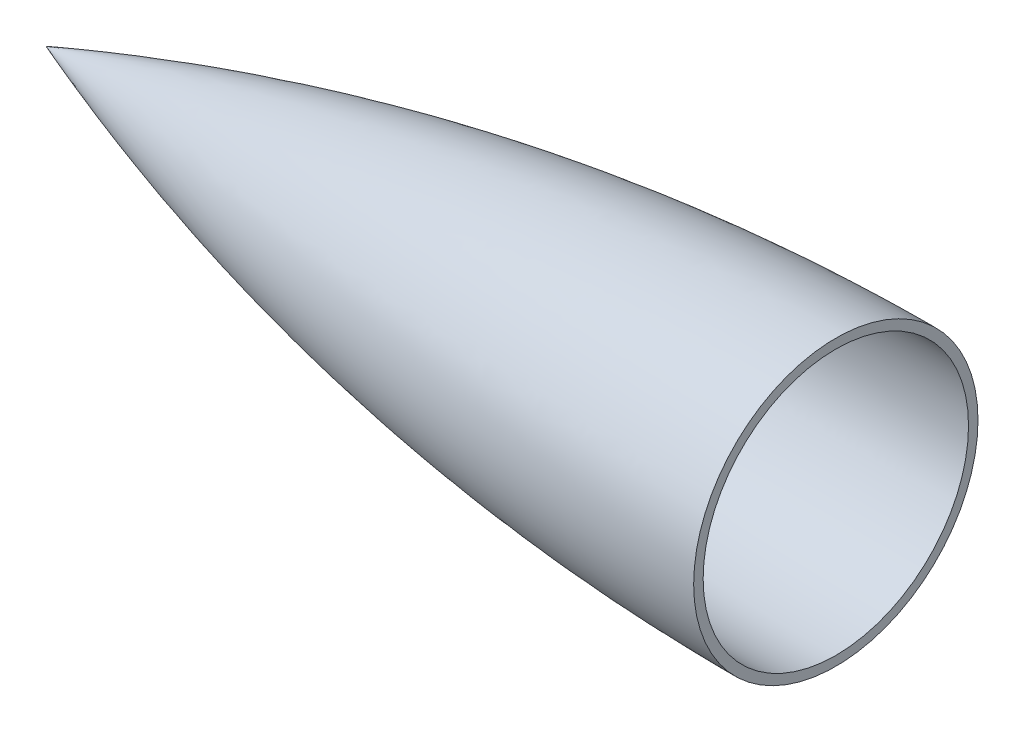
ISO-10303-21;
HEADER;
FILE_DESCRIPTION(('STEP AP214'),'2;1');
FILE_NAME('part.step','',(''),(''),'','','');
FILE_SCHEMA(('AUTOMOTIVE_DESIGN { 1 0 10303 214 1 1 1 1 }'));
ENDSEC;
DATA;
#1=APPLICATION_CONTEXT('core data for automotive mechanical design processes');
#2=APPLICATION_PROTOCOL_DEFINITION('international standard','automotive_design',2000,#1);
#3=PRODUCT_CONTEXT('',#1,'mechanical');
#4=PRODUCT('Part','Part','',(#3));
#5=PRODUCT_RELATED_PRODUCT_CATEGORY('part','',(#4));
#6=PRODUCT_DEFINITION_FORMATION('','',#4);
#7=PRODUCT_DEFINITION_CONTEXT('part definition',#1,'design');
#8=PRODUCT_DEFINITION('design','',#6,#7);
#9=PRODUCT_DEFINITION_SHAPE('','',#8);
#10=(LENGTH_UNIT() NAMED_UNIT(*) SI_UNIT(.MILLI.,.METRE.));
#11=(NAMED_UNIT(*) PLANE_ANGLE_UNIT() SI_UNIT($,.RADIAN.));
#12=(NAMED_UNIT(*) SI_UNIT($,.STERADIAN.) SOLID_ANGLE_UNIT());
#13=UNCERTAINTY_MEASURE_WITH_UNIT(LENGTH_MEASURE(1.E-05),#10,'distance_accuracy_value','');
#14=(GEOMETRIC_REPRESENTATION_CONTEXT(3) GLOBAL_UNCERTAINTY_ASSIGNED_CONTEXT((#13)) GLOBAL_UNIT_ASSIGNED_CONTEXT((#10,
#11,#12)) REPRESENTATION_CONTEXT('',''));
#15=CARTESIAN_POINT('',(0.,0.,0.));
#16=DIRECTION('',(0.,0.,1.));
#17=DIRECTION('',(1.,0.,0.));
#18=AXIS2_PLACEMENT_3D('',#15,#16,#17);
#19=CARTESIAN_POINT('',(250.000000001601,0.,-45.));
#20=CARTESIAN_POINT('',(249.682753819303,0.,-45.000000000001));
#21=CARTESIAN_POINT('',(249.047165821142,0.,-44.9994628827992));
#22=CARTESIAN_POINT('',(247.617281122081,0.,-44.9970458553814));
#23=CARTESIAN_POINT('',(246.231731715728,0.,-44.9906004634236));
#24=CARTESIAN_POINT('',(244.670319451456,0.,-44.9809324117025));
#25=CARTESIAN_POINT('',(243.163095115999,0.,-44.9680417436784));
#26=CARTESIAN_POINT('',(241.638882415672,0.,-44.9519285172921));
#27=CARTESIAN_POINT('',(240.120479762347,0.,-44.932592804978));
#28=CARTESIAN_POINT('',(238.220058241684,0.,-44.9043951660734));
#29=CARTESIAN_POINT('',(235.940682167867,0.,-44.864113404556));
#30=CARTESIAN_POINT('',(233.281021873147,0.,-44.807720155617));
#31=CARTESIAN_POINT('',(230.242044265543,0.,-44.7303833927708));
#32=CARTESIAN_POINT('',(227.20324496479,0.,-44.6401606837516));
#33=CARTESIAN_POINT('',(224.164957447808,0.,-44.5370536504946));
#34=CARTESIAN_POINT('',(221.127073954689,0.,-44.4210641462195));
#35=CARTESIAN_POINT('',(218.089745776704,0.,-44.2921942563917));
#36=CARTESIAN_POINT('',(215.052969657774,0.,-44.1504462992027));
#37=CARTESIAN_POINT('',(212.016834853689,0.,-43.9958228245218));
#38=CARTESIAN_POINT('',(208.981375405902,0.,-43.8283266109628));
#39=CARTESIAN_POINT('',(205.946657751534,0.,-43.6479606730414));
#40=CARTESIAN_POINT('',(202.154248213683,0.,-43.4064201459423));
#41=CARTESIAN_POINT('',(197.605051490867,0.,-43.0908455028409));
#42=CARTESIAN_POINT('',(192.300362370409,0.,-42.6851741792301));
#43=CARTESIAN_POINT('',(186.24201083089,0.,-42.1701533625944));
#44=CARTESIAN_POINT('',(180.188244336868,0.,-41.6037730978271));
#45=CARTESIAN_POINT('',(174.139498814474,0.,-40.9860741586634));
#46=CARTESIAN_POINT('',(166.585386817079,0.,-40.1498576349434));
#47=CARTESIAN_POINT('',(157.532234031388,0.,-39.0439456198505));
#48=CARTESIAN_POINT('',(148.495435574017,0.,-37.810162361996));
#49=CARTESIAN_POINT('',(139.477158719865,0.,-36.4488039435302));
#50=CARTESIAN_POINT('',(130.474994537663,0.,-34.985584453941));
#51=CARTESIAN_POINT('',(121.489808607384,0.,-33.4206449815079));
#52=CARTESIAN_POINT('',(112.527457587515,0.,-31.7288308559079));
#53=CARTESIAN_POINT('',(103.590096004027,0.,-29.9105498752083));
#54=CARTESIAN_POINT('',(96.1600172806627,0.,-28.3112226601881));
#55=CARTESIAN_POINT('',(90.2270253225319,0.,-26.9814008669732));
#56=CARTESIAN_POINT('',(82.8251339202143,0.,-25.2562839764021));
#57=CARTESIAN_POINT('',(73.9667295019805,0.,-23.085819843032));
#58=CARTESIAN_POINT('',(65.1396594601575,0.,-20.7903028519481));
#59=CARTESIAN_POINT('',(56.3461697320049,0.,-18.3703316152346));
#60=CARTESIAN_POINT('',(49.0415449608774,0.,-16.2709542187977));
#61=CARTESIAN_POINT('',(43.2124702427797,0.,-14.5420196195187));
#62=CARTESIAN_POINT('',(37.3979229210091,0.,-12.7635842736563));
#63=CARTESIAN_POINT('',(31.5992982435684,0.,-10.9361396269452));
#64=CARTESIAN_POINT('',(26.5382058407579,0.,-9.29376477167991));
#65=CARTESIAN_POINT('',(22.2118518676868,0.,-7.85601678704013));
#66=CARTESIAN_POINT('',(17.8907418367704,0.,-6.39272549032875));
#67=CARTESIAN_POINT('',(14.6616072499024,0.,-5.27898592233498));
#68=CARTESIAN_POINT('',(11.7854619936391,0.,-4.27079300681318));
#69=CARTESIAN_POINT('',(9.28953226291448,0.,-3.38429141929322));
#70=CARTESIAN_POINT('',(7.82992524395084,0.,-2.86186859651477));
#71=CARTESIAN_POINT('',(6.48097071990856,0.,-2.37717624226541));
#72=CARTESIAN_POINT('',(4.85947572254319,0.,-1.78764558499007));
#73=CARTESIAN_POINT('',(3.51779218985783,0.,-1.30136050625101));
#74=CARTESIAN_POINT('',(1.43519159810059,0.,-0.5322503252652));
#75=CARTESIAN_POINT('',(0.594667791723522,0.,-0.221248868355296));
#76=CARTESIAN_POINT('',(-8.35911975393574E-11,0.,3.11004655717512E-11));
#77=B_SPLINE_CURVE_WITH_KNOTS('',4,(#19,#20,#21,#22,#23,#24,#25,#26,#27,#28,#29,#30,#31,#32,#33,
#34,#35,#36,#37,#38,#39,#40,#41,#42,#43,#44,#45,#46,#47,#48,#49,#50,#51,#52,#53,#54,#55,#56,#57,
#58,#59,#60,#61,#62,#63,#64,#65,#66,#67,#68,#69,#70,#71,#72,#73,#74,#75,#76),.UNSPECIFIED.,.F.,
.F.,(5,1,1,1,1,1,1,1,1,1,1,1,1,1,1,1,1,1,1,1,1,1,1,1,1,1,1,1,1,1,1,1,1,1,1,1,1,1,1,1,1,1,1,1,1,
1,1,1,1,1,1,1,1,1,5),(0.0834130077958932,0.0883822961412844,0.0933515844866757,
0.0983208728320669,0.103290161177458,0.108259449522849,0.113228737868241,0.118198026213632,
0.123167314559023,0.13310589101726,0.143044467475496,0.152983043933732,0.162921620391969,
0.17286019724877,0.182798774105571,0.192737350962373,0.202675927819174,0.212614504519659,
0.222553081220144,0.23249165792063,0.242430234621115,0.262307387437352,0.282184540253589,
0.302061693760234,0.32193884726688,0.341816001873939,0.361693156480999,0.401447461179583,
0.44120176494361,0.461078919587591,0.480956074231572,0.520710380875337,0.560464681176746,
0.580341836465686,0.600218991754625,0.620096151034144,0.639973310313663,0.679727604095889,
0.719481905070318,0.739359062433057,0.759236219795796,0.779113374159564,0.798990528523332,
0.818867677687638,0.838744826851944,0.848683406381489,0.858621985911034,0.878499144970123,
0.883468435072133,0.888437725174143,0.893407015276152,0.898376305378162,0.903345595480171,
0.908314885582181,0.9182534657862),.UNSPECIFIED.);
#78=CARTESIAN_POINT('',(250.000000001601,0.,0.));
#79=DIRECTION('',(1.,0.,0.));
#80=AXIS1_PLACEMENT('',#78,#79);
#81=SURFACE_OF_REVOLUTION('',#77,#80);
#82=CARTESIAN_POINT('',(0.,0.,0.));
#83=VERTEX_POINT('',#82);
#84=VERTEX_LOOP('',#83);
#85=FACE_BOUND('',#84,.T.);
#86=CARTESIAN_POINT('',(250.000000001601,0.,0.));
#87=DIRECTION('',(1.,0.,0.));
#88=DIRECTION('',(0.,0.,-1.));
#89=AXIS2_PLACEMENT_3D('',#86,#87,#88);
#90=CIRCLE('',#89,44.9999999862204);
#91=CARTESIAN_POINT('',(250.000000001601,0.,-44.9999999862204));
#92=VERTEX_POINT('',#91);
#93=EDGE_CURVE('E11',#92,#92,#90,.T.);
#94=ORIENTED_EDGE('',*,*,#93,.F.);
#95=EDGE_LOOP('',(#94));
#96=FACE_BOUND('',#95,.T.);
#97=ADVANCED_FACE('F36',(#85,#96),#81,.F.);
#98=CARTESIAN_POINT('',(250.000000001601,0.,-44.9999999862204));
#99=DIRECTION('',(1.,0.,0.));
#100=DIRECTION('',(0.,0.,-1.));
#101=AXIS2_PLACEMENT_3D('',#98,#99,#100);
#102=PLANE('',#101);
#103=CARTESIAN_POINT('',(250.000000001601,0.,0.));
#104=DIRECTION('',(1.,0.,0.));
#105=DIRECTION('',(0.,0.,-1.));
#106=AXIS2_PLACEMENT_3D('',#103,#104,#105);
#107=CIRCLE('',#106,42.);
#108=CARTESIAN_POINT('',(250.000000001601,0.,-42.));
#109=VERTEX_POINT('',#108);
#110=EDGE_CURVE('E43',#109,#109,#107,.T.);
#111=ORIENTED_EDGE('',*,*,#110,.F.);
#112=EDGE_LOOP('',(#111));
#113=FACE_BOUND('',#112,.T.);
#114=ORIENTED_EDGE('',*,*,#93,.T.);
#115=EDGE_LOOP('',(#114));
#116=FACE_BOUND('',#115,.T.);
#117=ADVANCED_FACE('F52',(#113,#116),#102,.T.);
#118=CARTESIAN_POINT('',(250.000000001601,0.,-45.));
#119=CARTESIAN_POINT('',(249.682753819303,0.,-45.000000000001));
#120=CARTESIAN_POINT('',(249.047165821142,0.,-44.9994628827992));
#121=CARTESIAN_POINT('',(247.617281122081,0.,-44.9970458553814));
#122=CARTESIAN_POINT('',(246.231731715728,0.,-44.9906004634236));
#123=CARTESIAN_POINT('',(244.670319451456,0.,-44.9809324117025));
#124=CARTESIAN_POINT('',(243.163095115999,0.,-44.9680417436784));
#125=CARTESIAN_POINT('',(241.638882415672,0.,-44.9519285172921));
#126=CARTESIAN_POINT('',(240.120479762347,0.,-44.932592804978));
#127=CARTESIAN_POINT('',(238.220058241684,0.,-44.9043951660734));
#128=CARTESIAN_POINT('',(235.940682167867,0.,-44.864113404556));
#129=CARTESIAN_POINT('',(233.281021873147,0.,-44.807720155617));
#130=CARTESIAN_POINT('',(230.242044265543,0.,-44.7303833927708));
#131=CARTESIAN_POINT('',(227.20324496479,0.,-44.6401606837516));
#132=CARTESIAN_POINT('',(224.164957447808,0.,-44.5370536504946));
#133=CARTESIAN_POINT('',(221.127073954689,0.,-44.4210641462195));
#134=CARTESIAN_POINT('',(218.089745776704,0.,-44.2921942563917));
#135=CARTESIAN_POINT('',(215.052969657774,0.,-44.1504462992027));
#136=CARTESIAN_POINT('',(212.016834853689,0.,-43.9958228245218));
#137=CARTESIAN_POINT('',(208.981375405902,0.,-43.8283266109628));
#138=CARTESIAN_POINT('',(205.946657751534,0.,-43.6479606730414));
#139=CARTESIAN_POINT('',(202.154248213683,0.,-43.4064201459423));
#140=CARTESIAN_POINT('',(197.605051490867,0.,-43.0908455028409));
#141=CARTESIAN_POINT('',(192.300362370409,0.,-42.6851741792301));
#142=CARTESIAN_POINT('',(186.24201083089,0.,-42.1701533625944));
#143=CARTESIAN_POINT('',(180.188244336868,0.,-41.6037730978271));
#144=CARTESIAN_POINT('',(174.139498814474,0.,-40.9860741586634));
#145=CARTESIAN_POINT('',(166.585386817079,0.,-40.1498576349434));
#146=CARTESIAN_POINT('',(157.532234031388,0.,-39.0439456198505));
#147=CARTESIAN_POINT('',(148.495435574017,0.,-37.810162361996));
#148=CARTESIAN_POINT('',(139.477158719865,0.,-36.4488039435302));
#149=CARTESIAN_POINT('',(130.474994537663,0.,-34.985584453941));
#150=CARTESIAN_POINT('',(121.489808607384,0.,-33.4206449815079));
#151=CARTESIAN_POINT('',(112.527457587515,0.,-31.7288308559079));
#152=CARTESIAN_POINT('',(103.590096004027,0.,-29.9105498752083));
#153=CARTESIAN_POINT('',(96.1600172806627,0.,-28.3112226601881));
#154=CARTESIAN_POINT('',(90.2270253225319,0.,-26.9814008669732));
#155=CARTESIAN_POINT('',(82.8251339202143,0.,-25.2562839764021));
#156=CARTESIAN_POINT('',(73.9667295019805,0.,-23.085819843032));
#157=CARTESIAN_POINT('',(65.1396594601575,0.,-20.7903028519481));
#158=CARTESIAN_POINT('',(56.3461697320049,0.,-18.3703316152346));
#159=CARTESIAN_POINT('',(49.0415449608774,0.,-16.2709542187977));
#160=CARTESIAN_POINT('',(43.2124702427797,0.,-14.5420196195187));
#161=CARTESIAN_POINT('',(37.3979229210091,0.,-12.7635842736563));
#162=CARTESIAN_POINT('',(31.5992982435684,0.,-10.9361396269452));
#163=CARTESIAN_POINT('',(26.5382058407579,0.,-9.29376477167991));
#164=CARTESIAN_POINT('',(22.2118518676868,0.,-7.85601678704013));
#165=CARTESIAN_POINT('',(17.8907418367704,0.,-6.39272549032875));
#166=CARTESIAN_POINT('',(14.6616072499024,0.,-5.27898592233498));
#167=CARTESIAN_POINT('',(11.7854619936391,0.,-4.27079300681318));
#168=CARTESIAN_POINT('',(9.43568120916972,0.,-3.43620044192104));
#169=CARTESIAN_POINT('',(8.49349497597747,0.,-3.09931886347783));
#170=CARTESIAN_POINT('',(7.93216719962397,0.,-2.89813785104592));
#171=CARTESIAN_POINT('',(7.72477390379313,0.,-2.82372050747118));
#172=B_SPLINE_CURVE_WITH_KNOTS('',4,(#118,#119,#120,#121,#122,#123,#124,#125,#126,#127,#128,
#129,#130,#131,#132,#133,#134,#135,#136,#137,#138,#139,#140,#141,#142,#143,#144,#145,#146,#147,
#148,#149,#150,#151,#152,#153,#154,#155,#156,#157,#158,#159,#160,#161,#162,#163,#164,#165,#166,
#167,#168,#169,#170,#171),.UNSPECIFIED.,.F.,.F.,(5,1,1,1,1,1,1,1,1,1,1,1,1,1,1,1,1,1,1,1,1,1,1,
1,1,1,1,1,1,1,1,1,1,1,1,1,1,1,1,1,1,1,1,1,1,1,1,1,1,1,5),(0.0834130077958932,0.0883822961412844,
0.0933515844866757,0.0983208728320669,0.103290161177458,0.108259449522849,0.113228737868241,
0.118198026213632,0.123167314559023,0.13310589101726,0.143044467475496,0.152983043933732,
0.162921620391969,0.17286019724877,0.182798774105571,0.192737350962373,0.202675927819174,
0.212614504519659,0.222553081220144,0.23249165792063,0.242430234621115,0.262307387437352,
0.282184540253589,0.302061693760234,0.32193884726688,0.341816001873939,0.361693156480999,
0.401447461179583,0.44120176494361,0.461078919587591,0.480956074231572,0.520710380875337,
0.560464681176746,0.580341836465686,0.600218991754625,0.620096151034144,0.639973310313663,
0.679727604095889,0.719481905070318,0.739359062433057,0.759236219795796,0.779113374159564,
0.798990528523332,0.818867677687638,0.838744826851944,0.848683406381489,0.858621985911034,
0.878499144970123,0.883468435072133,0.888437725174143,0.89137018093559),.UNSPECIFIED.);
#173=CARTESIAN_POINT('',(250.000000001601,0.,0.));
#174=DIRECTION('',(1.,0.,0.));
#175=AXIS1_PLACEMENT('',#173,#174);
#176=SURFACE_OF_REVOLUTION('',#172,#175);
#177=OFFSET_SURFACE('',#176,3.,.F.);
#178=CARTESIAN_POINT('',(8.73798784748263,0.,0.));
#179=VERTEX_POINT('',#178);
#180=VERTEX_LOOP('',#179);
#181=FACE_BOUND('',#180,.T.);
#182=ORIENTED_EDGE('',*,*,#110,.T.);
#183=EDGE_LOOP('',(#182));
#184=FACE_BOUND('',#183,.T.);
#185=ADVANCED_FACE('F49',(#181,#184),#177,.T.);
#186=CLOSED_SHELL('',(#97,#117,#185));
#187=MANIFOLD_SOLID_BREP('B2',#186);
#188=ADVANCED_BREP_SHAPE_REPRESENTATION('',(#18,#187),#14);
#189=SHAPE_DEFINITION_REPRESENTATION(#9,#188);
ENDSEC;
END-ISO-10303-21;
